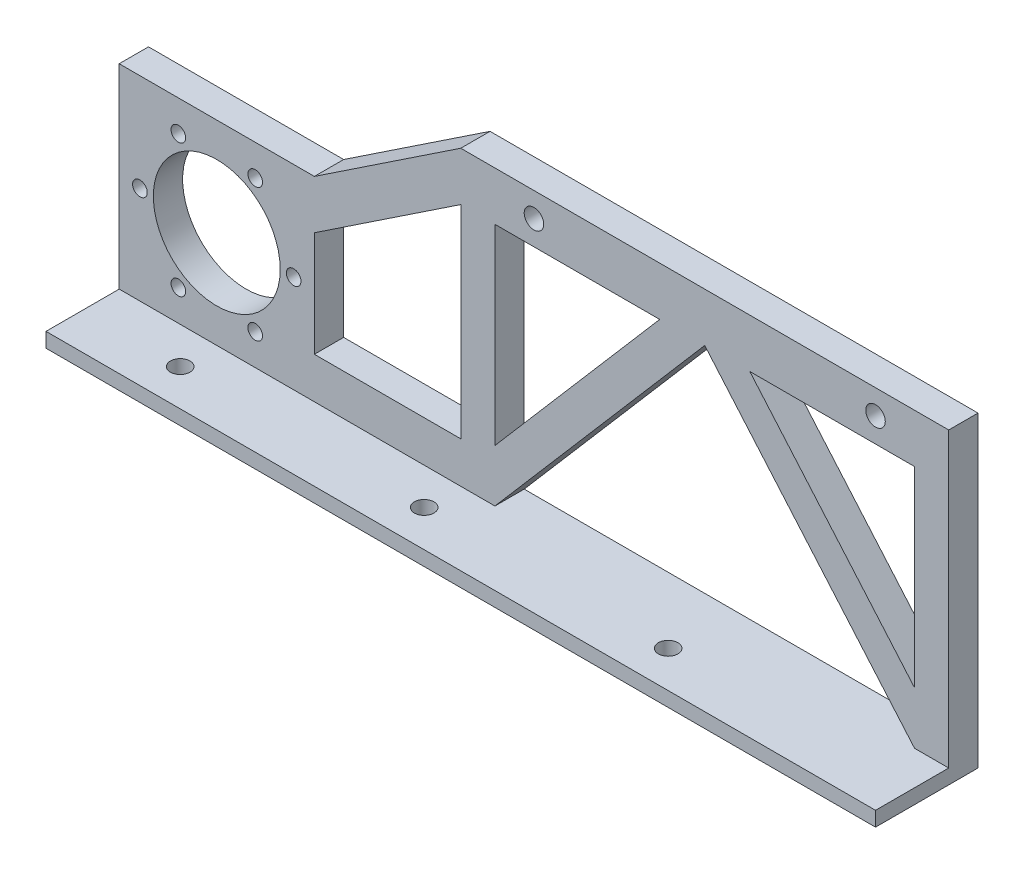
ISO-10303-21;
HEADER;
FILE_DESCRIPTION(('STEP AP214'),'2;1');
FILE_NAME('part.step','',(''),(''),'','','');
FILE_SCHEMA(('AUTOMOTIVE_DESIGN { 1 0 10303 214 1 1 1 1 }'));
ENDSEC;
DATA;
#1=APPLICATION_CONTEXT('core data for automotive mechanical design processes');
#2=APPLICATION_PROTOCOL_DEFINITION('international standard','automotive_design',2000,#1);
#3=PRODUCT_CONTEXT('',#1,'mechanical');
#4=PRODUCT('Part','Part','',(#3));
#5=PRODUCT_RELATED_PRODUCT_CATEGORY('part','',(#4));
#6=PRODUCT_DEFINITION_FORMATION('','',#4);
#7=PRODUCT_DEFINITION_CONTEXT('part definition',#1,'design');
#8=PRODUCT_DEFINITION('design','',#6,#7);
#9=PRODUCT_DEFINITION_SHAPE('','',#8);
#10=(LENGTH_UNIT() NAMED_UNIT(*) SI_UNIT(.MILLI.,.METRE.));
#11=(NAMED_UNIT(*) PLANE_ANGLE_UNIT() SI_UNIT($,.RADIAN.));
#12=(NAMED_UNIT(*) SI_UNIT($,.STERADIAN.) SOLID_ANGLE_UNIT());
#13=UNCERTAINTY_MEASURE_WITH_UNIT(LENGTH_MEASURE(1.E-05),#10,'distance_accuracy_value','');
#14=(GEOMETRIC_REPRESENTATION_CONTEXT(3) GLOBAL_UNCERTAINTY_ASSIGNED_CONTEXT((#13)) GLOBAL_UNIT_ASSIGNED_CONTEXT((#10,
#11,#12)) REPRESENTATION_CONTEXT('',''));
#15=CARTESIAN_POINT('',(0.,0.,0.));
#16=DIRECTION('',(0.,0.,1.));
#17=DIRECTION('',(1.,0.,0.));
#18=AXIS2_PLACEMENT_3D('',#15,#16,#17);
#19=CARTESIAN_POINT('',(0.,-5.,6.));
#20=DIRECTION('',(0.,1.,0.));
#21=DIRECTION('',(0.,0.,1.));
#22=AXIS2_PLACEMENT_3D('',#19,#20,#21);
#23=PLANE('',#22);
#24=DIRECTION('',(1.,0.,0.));
#25=VECTOR('',#24,1.);
#26=CARTESIAN_POINT('',(0.,-5.,0.));
#27=LINE('',#26,#25);
#28=CARTESIAN_POINT('',(-43.,-5.,0.));
#29=VERTEX_POINT('',#28);
#30=CARTESIAN_POINT('',(-9.23257277252664,-5.,0.));
#31=VERTEX_POINT('',#30);
#32=EDGE_CURVE('E164',#29,#31,#27,.T.);
#33=ORIENTED_EDGE('',*,*,#32,.T.);
#34=DIRECTION('',(0.,0.,-1.));
#35=VECTOR('',#34,1.);
#36=CARTESIAN_POINT('',(-9.23257277252664,-5.,6.));
#37=LINE('',#36,#35);
#38=CARTESIAN_POINT('',(-9.23257277252664,-5.,6.));
#39=VERTEX_POINT('',#38);
#40=EDGE_CURVE('E11',#39,#31,#37,.T.);
#41=ORIENTED_EDGE('',*,*,#40,.F.);
#42=DIRECTION('',(1.,0.,0.));
#43=VECTOR('',#42,1.);
#44=CARTESIAN_POINT('',(0.,-5.,6.));
#45=LINE('',#44,#43);
#46=CARTESIAN_POINT('',(-43.,-5.,6.));
#47=VERTEX_POINT('',#46);
#48=EDGE_CURVE('E155',#47,#39,#45,.T.);
#49=ORIENTED_EDGE('',*,*,#48,.F.);
#50=DIRECTION('',(0.,0.,-1.));
#51=VECTOR('',#50,1.);
#52=CARTESIAN_POINT('',(-43.,-5.,6.));
#53=LINE('',#52,#51);
#54=EDGE_CURVE('E54',#47,#29,#53,.T.);
#55=ORIENTED_EDGE('',*,*,#54,.T.);
#56=EDGE_LOOP('',(#33,#41,#49,#55));
#57=FACE_BOUND('',#56,.T.);
#58=ADVANCED_FACE('F35',(#57),#23,.F.);
#59=CARTESIAN_POINT('',(-2.83546376898519,2.43849884132727,6.));
#60=DIRECTION('',(-0.758185196311683,0.652039268828047,0.));
#61=DIRECTION('',(-0.652039268828047,-0.758185196311683,0.));
#62=AXIS2_PLACEMENT_3D('',#59,#60,#61);
#63=PLANE('',#62);
#64=DIRECTION('',(0.652039268828047,0.758185196311683,0.));
#65=VECTOR('',#64,1.);
#66=CARTESIAN_POINT('',(-2.83546376898519,2.43849884132727,0.));
#67=LINE('',#66,#65);
#68=CARTESIAN_POINT('',(-43.,-44.2644502645039,0.));
#69=VERTEX_POINT('',#68);
#70=EDGE_CURVE('E241',#69,#31,#67,.T.);
#71=ORIENTED_EDGE('',*,*,#70,.F.);
#72=DIRECTION('',(0.,0.,-1.));
#73=VECTOR('',#72,1.);
#74=CARTESIAN_POINT('',(-43.,-44.2644502645039,6.));
#75=LINE('',#74,#73);
#76=CARTESIAN_POINT('',(-43.,-44.2644502645039,6.));
#77=VERTEX_POINT('',#76);
#78=EDGE_CURVE('E45',#77,#69,#75,.T.);
#79=ORIENTED_EDGE('',*,*,#78,.F.);
#80=DIRECTION('',(0.652039268828047,0.758185196311683,0.));
#81=VECTOR('',#80,1.);
#82=CARTESIAN_POINT('',(-2.83546376898519,2.43849884132727,6.));
#83=LINE('',#82,#81);
#84=EDGE_CURVE('E160',#77,#39,#83,.T.);
#85=ORIENTED_EDGE('',*,*,#84,.T.);
#86=ORIENTED_EDGE('',*,*,#40,.T.);
#87=EDGE_LOOP('',(#71,#79,#85,#86));
#88=FACE_BOUND('',#87,.T.);
#89=ADVANCED_FACE('F167',(#88),#63,.T.);
#90=CARTESIAN_POINT('',(43.,0.,6.));
#91=DIRECTION('',(1.,0.,0.));
#92=DIRECTION('',(0.,1.,0.));
#93=AXIS2_PLACEMENT_3D('',#90,#91,#92);
#94=PLANE('',#93);
#95=DIRECTION('',(0.,-1.,0.));
#96=VECTOR('',#95,1.);
#97=CARTESIAN_POINT('',(43.,0.,0.));
#98=LINE('',#97,#96);
#99=CARTESIAN_POINT('',(43.,-5.,0.));
#100=VERTEX_POINT('',#99);
#101=CARTESIAN_POINT('',(43.,-44.2644502645039,0.));
#102=VERTEX_POINT('',#101);
#103=EDGE_CURVE('E233',#100,#102,#98,.T.);
#104=ORIENTED_EDGE('',*,*,#103,.T.);
#105=DIRECTION('',(0.,0.,-1.));
#106=VECTOR('',#105,1.);
#107=CARTESIAN_POINT('',(43.,-44.2644502645039,6.));
#108=LINE('',#107,#106);
#109=CARTESIAN_POINT('',(43.,-44.2644502645039,6.));
#110=VERTEX_POINT('',#109);
#111=EDGE_CURVE('E275',#110,#102,#108,.T.);
#112=ORIENTED_EDGE('',*,*,#111,.F.);
#113=DIRECTION('',(0.,-1.,0.));
#114=VECTOR('',#113,1.);
#115=CARTESIAN_POINT('',(43.,0.,6.));
#116=LINE('',#115,#114);
#117=CARTESIAN_POINT('',(43.,-5.,6.));
#118=VERTEX_POINT('',#117);
#119=EDGE_CURVE('E388',#118,#110,#116,.T.);
#120=ORIENTED_EDGE('',*,*,#119,.F.);
#121=DIRECTION('',(0.,0.,-1.));
#122=VECTOR('',#121,1.);
#123=CARTESIAN_POINT('',(43.,-5.,6.));
#124=LINE('',#123,#122);
#125=EDGE_CURVE('E277',#118,#100,#124,.T.);
#126=ORIENTED_EDGE('',*,*,#125,.T.);
#127=EDGE_LOOP('',(#104,#112,#120,#126));
#128=FACE_BOUND('',#127,.T.);
#129=ADVANCED_FACE('F403',(#128),#94,.F.);
#130=CARTESIAN_POINT('',(2.83546376898519,2.43849884132726,6.));
#131=DIRECTION('',(0.758185196311683,0.652039268828047,0.));
#132=DIRECTION('',(-0.652039268828048,0.758185196311683,0.));
#133=AXIS2_PLACEMENT_3D('',#130,#131,#132);
#134=PLANE('',#133);
#135=DIRECTION('',(0.652039268828048,-0.758185196311683,0.));
#136=VECTOR('',#135,1.);
#137=CARTESIAN_POINT('',(2.83546376898519,2.43849884132726,0.));
#138=LINE('',#137,#136);
#139=CARTESIAN_POINT('',(9.23257277252663,-5.,0.));
#140=VERTEX_POINT('',#139);
#141=EDGE_CURVE('E236',#140,#102,#138,.T.);
#142=ORIENTED_EDGE('',*,*,#141,.F.);
#143=DIRECTION('',(0.,0.,-1.));
#144=VECTOR('',#143,1.);
#145=CARTESIAN_POINT('',(9.23257277252663,-5.,6.));
#146=LINE('',#145,#144);
#147=CARTESIAN_POINT('',(9.23257277252663,-5.,6.));
#148=VERTEX_POINT('',#147);
#149=EDGE_CURVE('E280',#148,#140,#146,.T.);
#150=ORIENTED_EDGE('',*,*,#149,.F.);
#151=DIRECTION('',(0.652039268828048,-0.758185196311683,0.));
#152=VECTOR('',#151,1.);
#153=CARTESIAN_POINT('',(2.83546376898519,2.43849884132726,6.));
#154=LINE('',#153,#152);
#155=EDGE_CURVE('E389',#148,#110,#154,.T.);
#156=ORIENTED_EDGE('',*,*,#155,.T.);
#157=ORIENTED_EDGE('',*,*,#111,.T.);
#158=EDGE_LOOP('',(#142,#150,#156,#157));
#159=FACE_BOUND('',#158,.T.);
#160=ADVANCED_FACE('F405',(#159),#134,.T.);
#161=CARTESIAN_POINT('',(-13.0769230769231,19.6153846153846,6.));
#162=DIRECTION('',(0.554700196225229,-0.832050294337844,0.));
#163=DIRECTION('',(0.832050294337844,0.554700196225229,0.));
#164=AXIS2_PLACEMENT_3D('',#161,#162,#163);
#165=PLANE('',#164);
#166=DIRECTION('',(-0.832050294337844,-0.554700196225229,0.));
#167=VECTOR('',#166,1.);
#168=CARTESIAN_POINT('',(-13.0769230769231,19.6153846153846,0.));
#169=LINE('',#168,#167);
#170=CARTESIAN_POINT('',(-50.,-5.,0.));
#171=VERTEX_POINT('',#170);
#172=CARTESIAN_POINT('',(-80.,-25.,0.));
#173=VERTEX_POINT('',#172);
#174=EDGE_CURVE('E221',#171,#173,#169,.T.);
#175=ORIENTED_EDGE('',*,*,#174,.F.);
#176=DIRECTION('',(0.,0.,-1.));
#177=VECTOR('',#176,1.);
#178=CARTESIAN_POINT('',(-50.,-5.,6.));
#179=LINE('',#178,#177);
#180=CARTESIAN_POINT('',(-50.,-5.,6.));
#181=VERTEX_POINT('',#180);
#182=EDGE_CURVE('E281',#181,#171,#179,.T.);
#183=ORIENTED_EDGE('',*,*,#182,.F.);
#184=DIRECTION('',(-0.832050294337844,-0.554700196225229,0.));
#185=VECTOR('',#184,1.);
#186=CARTESIAN_POINT('',(-13.0769230769231,19.6153846153846,6.));
#187=LINE('',#186,#185);
#188=CARTESIAN_POINT('',(-80.,-25.,6.));
#189=VERTEX_POINT('',#188);
#190=EDGE_CURVE('E377',#181,#189,#187,.T.);
#191=ORIENTED_EDGE('',*,*,#190,.T.);
#192=DIRECTION('',(0.,0.,-1.));
#193=VECTOR('',#192,1.);
#194=CARTESIAN_POINT('',(-80.,-25.,6.));
#195=LINE('',#194,#193);
#196=EDGE_CURVE('E284',#189,#173,#195,.T.);
#197=ORIENTED_EDGE('',*,*,#196,.T.);
#198=EDGE_LOOP('',(#175,#183,#191,#197));
#199=FACE_BOUND('',#198,.T.);
#200=ADVANCED_FACE('F779',(#199),#165,.T.);
#201=CARTESIAN_POINT('',(-50.,0.,6.));
#202=DIRECTION('',(1.,0.,0.));
#203=DIRECTION('',(0.,1.,0.));
#204=AXIS2_PLACEMENT_3D('',#201,#202,#203);
#205=PLANE('',#204);
#206=DIRECTION('',(0.,-1.,0.));
#207=VECTOR('',#206,1.);
#208=CARTESIAN_POINT('',(-50.,0.,0.));
#209=LINE('',#208,#207);
#210=CARTESIAN_POINT('',(-50.,-46.5715813831336,0.));
#211=VERTEX_POINT('',#210);
#212=EDGE_CURVE('E224',#171,#211,#209,.T.);
#213=ORIENTED_EDGE('',*,*,#212,.T.);
#214=DIRECTION('',(0.,0.,-1.));
#215=VECTOR('',#214,1.);
#216=CARTESIAN_POINT('',(-50.,-46.5715813831336,6.));
#217=LINE('',#216,#215);
#218=CARTESIAN_POINT('',(-50.,-46.5715813831336,6.));
#219=VERTEX_POINT('',#218);
#220=EDGE_CURVE('E290',#219,#211,#217,.T.);
#221=ORIENTED_EDGE('',*,*,#220,.F.);
#222=DIRECTION('',(0.,-1.,0.));
#223=VECTOR('',#222,1.);
#224=CARTESIAN_POINT('',(-50.,0.,6.));
#225=LINE('',#224,#223);
#226=EDGE_CURVE('E380',#181,#219,#225,.T.);
#227=ORIENTED_EDGE('',*,*,#226,.F.);
#228=ORIENTED_EDGE('',*,*,#182,.T.);
#229=EDGE_LOOP('',(#213,#221,#227,#228));
#230=FACE_BOUND('',#229,.T.);
#231=ADVANCED_FACE('F769',(#230),#205,.F.);
#232=CARTESIAN_POINT('',(0.,-46.5715813831336,6.));
#233=DIRECTION('',(0.,-1.,0.));
#234=DIRECTION('',(1.,0.,0.));
#235=AXIS2_PLACEMENT_3D('',#232,#233,#234);
#236=PLANE('',#235);
#237=DIRECTION('',(-1.,0.,0.));
#238=VECTOR('',#237,1.);
#239=CARTESIAN_POINT('',(0.,-46.5715813831336,0.));
#240=LINE('',#239,#238);
#241=CARTESIAN_POINT('',(-80.,-46.5715813831336,0.));
#242=VERTEX_POINT('',#241);
#243=EDGE_CURVE('E227',#211,#242,#240,.T.);
#244=ORIENTED_EDGE('',*,*,#243,.T.);
#245=DIRECTION('',(0.,0.,-1.));
#246=VECTOR('',#245,1.);
#247=CARTESIAN_POINT('',(-80.,-46.5715813831336,6.));
#248=LINE('',#247,#246);
#249=CARTESIAN_POINT('',(-80.,-46.5715813831336,6.));
#250=VERTEX_POINT('',#249);
#251=EDGE_CURVE('E286',#250,#242,#248,.T.);
#252=ORIENTED_EDGE('',*,*,#251,.F.);
#253=DIRECTION('',(-1.,0.,0.));
#254=VECTOR('',#253,1.);
#255=CARTESIAN_POINT('',(0.,-46.5715813831336,6.));
#256=LINE('',#255,#254);
#257=EDGE_CURVE('E383',#219,#250,#256,.T.);
#258=ORIENTED_EDGE('',*,*,#257,.F.);
#259=ORIENTED_EDGE('',*,*,#220,.T.);
#260=EDGE_LOOP('',(#244,#252,#258,#259));
#261=FACE_BOUND('',#260,.T.);
#262=ADVANCED_FACE('F528',(#261),#236,.F.);
#263=CARTESIAN_POINT('',(-2.4718326051966,-2.12577604046907,6.));
#264=DIRECTION('',(0.758185196311683,0.652039268828047,0.));
#265=DIRECTION('',(-0.652039268828048,0.758185196311683,0.));
#266=AXIS2_PLACEMENT_3D('',#263,#264,#265);
#267=PLANE('',#266);
#268=DIRECTION('',(0.652039268828048,-0.758185196311683,0.));
#269=VECTOR('',#268,1.);
#270=CARTESIAN_POINT('',(-2.4718326051966,-2.12577604046907,0.));
#271=LINE('',#270,#269);
#272=CARTESIAN_POINT('',(0.,-5.,0.));
#273=VERTEX_POINT('',#272);
#274=CARTESIAN_POINT('',(43.,-55.,0.));
#275=VERTEX_POINT('',#274);
#276=EDGE_CURVE('E200',#273,#275,#271,.T.);
#277=ORIENTED_EDGE('',*,*,#276,.T.);
#278=DIRECTION('',(0.,0.,-1.));
#279=VECTOR('',#278,1.);
#280=CARTESIAN_POINT('',(43.,-55.,6.));
#281=LINE('',#280,#279);
#282=CARTESIAN_POINT('',(43.,-55.,6.));
#283=VERTEX_POINT('',#282);
#284=EDGE_CURVE('E287',#283,#275,#281,.T.);
#285=ORIENTED_EDGE('',*,*,#284,.F.);
#286=DIRECTION('',(0.652039268828048,-0.758185196311683,0.));
#287=VECTOR('',#286,1.);
#288=CARTESIAN_POINT('',(-2.4718326051966,-2.12577604046907,6.));
#289=LINE('',#288,#287);
#290=CARTESIAN_POINT('',(0.,-5.,6.));
#291=VERTEX_POINT('',#290);
#292=EDGE_CURVE('E273',#291,#283,#289,.T.);
#293=ORIENTED_EDGE('',*,*,#292,.F.);
#294=DIRECTION('',(0.,0.,-1.));
#295=VECTOR('',#294,1.);
#296=CARTESIAN_POINT('',(0.,-5.,6.));
#297=LINE('',#296,#295);
#298=EDGE_CURVE('E199',#291,#273,#297,.T.);
#299=ORIENTED_EDGE('',*,*,#298,.T.);
#300=EDGE_LOOP('',(#277,#285,#293,#299));
#301=FACE_BOUND('',#300,.T.);
#302=ADVANCED_FACE('F37',(#301),#267,.F.);
#303=CARTESIAN_POINT('',(50.,0.,6.));
#304=DIRECTION('',(1.,0.,0.));
#305=DIRECTION('',(0.,0.,-1.));
#306=AXIS2_PLACEMENT_3D('',#303,#304,#305);
#307=PLANE('',#306);
#308=DIRECTION('',(0.,-1.,0.));
#309=VECTOR('',#308,1.);
#310=CARTESIAN_POINT('',(50.,0.,0.));
#311=LINE('',#310,#309);
#312=CARTESIAN_POINT('',(50.,5.,0.));
#313=VERTEX_POINT('',#312);
#314=CARTESIAN_POINT('',(50.,-58.,0.));
#315=VERTEX_POINT('',#314);
#316=EDGE_CURVE('E203',#313,#315,#311,.T.);
#317=ORIENTED_EDGE('',*,*,#316,.F.);
#318=DIRECTION('',(0.,0.,-1.));
#319=VECTOR('',#318,1.);
#320=CARTESIAN_POINT('',(50.,5.,6.));
#321=LINE('',#320,#319);
#322=CARTESIAN_POINT('',(50.,5.,6.));
#323=VERTEX_POINT('',#322);
#324=EDGE_CURVE('E115',#323,#313,#321,.T.);
#325=ORIENTED_EDGE('',*,*,#324,.F.);
#326=DIRECTION('',(0.,-1.,0.));
#327=VECTOR('',#326,1.);
#328=CARTESIAN_POINT('',(50.,0.,6.));
#329=LINE('',#328,#327);
#330=CARTESIAN_POINT('',(50.,-55.,6.));
#331=VERTEX_POINT('',#330);
#332=EDGE_CURVE('E359',#323,#331,#329,.T.);
#333=ORIENTED_EDGE('',*,*,#332,.T.);
#334=DIRECTION('',(0.,0.,1.));
#335=VECTOR('',#334,1.);
#336=CARTESIAN_POINT('',(50.,-55.,0.));
#337=LINE('',#336,#335);
#338=CARTESIAN_POINT('',(50.,-55.,21.));
#339=VERTEX_POINT('',#338);
#340=EDGE_CURVE('E346',#331,#339,#337,.T.);
#341=ORIENTED_EDGE('',*,*,#340,.T.);
#342=DIRECTION('',(0.,1.,0.));
#343=VECTOR('',#342,1.);
#344=CARTESIAN_POINT('',(50.,-55.,21.));
#345=LINE('',#344,#343);
#346=CARTESIAN_POINT('',(50.,-58.,21.));
#347=VERTEX_POINT('',#346);
#348=EDGE_CURVE('E327',#347,#339,#345,.T.);
#349=ORIENTED_EDGE('',*,*,#348,.F.);
#350=DIRECTION('',(0.,0.,1.));
#351=VECTOR('',#350,1.);
#352=CARTESIAN_POINT('',(50.,-58.,0.));
#353=LINE('',#352,#351);
#354=EDGE_CURVE('E349',#315,#347,#353,.T.);
#355=ORIENTED_EDGE('',*,*,#354,.F.);
#356=EDGE_LOOP('',(#317,#325,#333,#341,#349,#355));
#357=FACE_BOUND('',#356,.T.);
#358=ADVANCED_FACE('F522',(#357),#307,.T.);
#359=CARTESIAN_POINT('',(0.,5.,6.));
#360=DIRECTION('',(0.,1.,0.));
#361=DIRECTION('',(0.,0.,1.));
#362=AXIS2_PLACEMENT_3D('',#359,#360,#361);
#363=PLANE('',#362);
#364=DIRECTION('',(1.,0.,0.));
#365=VECTOR('',#364,1.);
#366=CARTESIAN_POINT('',(0.,5.,0.));
#367=LINE('',#366,#365);
#368=CARTESIAN_POINT('',(-50.,5.,0.));
#369=VERTEX_POINT('',#368);
#370=EDGE_CURVE('E207',#369,#313,#367,.T.);
#371=ORIENTED_EDGE('',*,*,#370,.F.);
#372=DIRECTION('',(0.,0.,-1.));
#373=VECTOR('',#372,1.);
#374=CARTESIAN_POINT('',(-50.,5.,6.));
#375=LINE('',#374,#373);
#376=CARTESIAN_POINT('',(-50.,5.,6.));
#377=VERTEX_POINT('',#376);
#378=EDGE_CURVE('E303',#377,#369,#375,.T.);
#379=ORIENTED_EDGE('',*,*,#378,.F.);
#380=DIRECTION('',(1.,0.,0.));
#381=VECTOR('',#380,1.);
#382=CARTESIAN_POINT('',(0.,5.,6.));
#383=LINE('',#382,#381);
#384=EDGE_CURVE('E361',#377,#323,#383,.T.);
#385=ORIENTED_EDGE('',*,*,#384,.T.);
#386=ORIENTED_EDGE('',*,*,#324,.T.);
#387=EDGE_LOOP('',(#371,#379,#385,#386));
#388=FACE_BOUND('',#387,.T.);
#389=ADVANCED_FACE('F519',(#388),#363,.T.);
#390=CARTESIAN_POINT('',(-17.6923076923077,26.5384615384615,6.));
#391=DIRECTION('',(-0.554700196225229,0.832050294337844,0.));
#392=DIRECTION('',(-0.832050294337844,-0.554700196225229,0.));
#393=AXIS2_PLACEMENT_3D('',#390,#391,#392);
#394=PLANE('',#393);
#395=DIRECTION('',(0.832050294337844,0.554700196225229,0.));
#396=VECTOR('',#395,1.);
#397=CARTESIAN_POINT('',(-17.6923076923077,26.5384615384615,0.));
#398=LINE('',#397,#396);
#399=CARTESIAN_POINT('',(-80.,-15.,0.));
#400=VERTEX_POINT('',#399);
#401=EDGE_CURVE('E210',#400,#369,#398,.T.);
#402=ORIENTED_EDGE('',*,*,#401,.F.);
#403=DIRECTION('',(0.,0.,-1.));
#404=VECTOR('',#403,1.);
#405=CARTESIAN_POINT('',(-80.,-15.,6.));
#406=LINE('',#405,#404);
#407=CARTESIAN_POINT('',(-80.,-15.,6.));
#408=VERTEX_POINT('',#407);
#409=EDGE_CURVE('E301',#408,#400,#406,.T.);
#410=ORIENTED_EDGE('',*,*,#409,.F.);
#411=DIRECTION('',(0.832050294337844,0.554700196225229,0.));
#412=VECTOR('',#411,1.);
#413=CARTESIAN_POINT('',(-17.6923076923077,26.5384615384615,6.));
#414=LINE('',#413,#412);
#415=EDGE_CURVE('E364',#408,#377,#414,.T.);
#416=ORIENTED_EDGE('',*,*,#415,.T.);
#417=ORIENTED_EDGE('',*,*,#378,.T.);
#418=EDGE_LOOP('',(#402,#410,#416,#417));
#419=FACE_BOUND('',#418,.T.);
#420=ADVANCED_FACE('F511',(#419),#394,.T.);
#421=CARTESIAN_POINT('',(0.,-15.,6.));
#422=DIRECTION('',(0.,-1.,0.));
#423=DIRECTION('',(1.,0.,0.));
#424=AXIS2_PLACEMENT_3D('',#421,#422,#423);
#425=PLANE('',#424);
#426=DIRECTION('',(-1.,0.,0.));
#427=VECTOR('',#426,1.);
#428=CARTESIAN_POINT('',(0.,-15.,0.));
#429=LINE('',#428,#427);
#430=CARTESIAN_POINT('',(-120.,-15.,0.));
#431=VERTEX_POINT('',#430);
#432=EDGE_CURVE('E213',#400,#431,#429,.T.);
#433=ORIENTED_EDGE('',*,*,#432,.T.);
#434=DIRECTION('',(0.,0.,-1.));
#435=VECTOR('',#434,1.);
#436=CARTESIAN_POINT('',(-120.,-15.,6.));
#437=LINE('',#436,#435);
#438=CARTESIAN_POINT('',(-120.,-15.,6.));
#439=VERTEX_POINT('',#438);
#440=EDGE_CURVE('E299',#439,#431,#437,.T.);
#441=ORIENTED_EDGE('',*,*,#440,.F.);
#442=DIRECTION('',(-1.,0.,0.));
#443=VECTOR('',#442,1.);
#444=CARTESIAN_POINT('',(0.,-15.,6.));
#445=LINE('',#444,#443);
#446=EDGE_CURVE('E367',#408,#439,#445,.T.);
#447=ORIENTED_EDGE('',*,*,#446,.F.);
#448=ORIENTED_EDGE('',*,*,#409,.T.);
#449=EDGE_LOOP('',(#433,#441,#447,#448));
#450=FACE_BOUND('',#449,.T.);
#451=ADVANCED_FACE('F500',(#450),#425,.F.);
#452=CARTESIAN_POINT('',(-120.,0.,6.));
#453=DIRECTION('',(-1.,0.,0.));
#454=DIRECTION('',(0.,0.,1.));
#455=AXIS2_PLACEMENT_3D('',#452,#453,#454);
#456=PLANE('',#455);
#457=DIRECTION('',(0.,1.,0.));
#458=VECTOR('',#457,1.);
#459=CARTESIAN_POINT('',(-120.,0.,0.));
#460=LINE('',#459,#458);
#461=CARTESIAN_POINT('',(-120.,-58.,0.));
#462=VERTEX_POINT('',#461);
#463=EDGE_CURVE('E216',#462,#431,#460,.T.);
#464=ORIENTED_EDGE('',*,*,#463,.F.);
#465=DIRECTION('',(0.,0.,1.));
#466=VECTOR('',#465,1.);
#467=CARTESIAN_POINT('',(-120.,-58.,0.));
#468=LINE('',#467,#466);
#469=CARTESIAN_POINT('',(-120.,-58.,21.));
#470=VERTEX_POINT('',#469);
#471=EDGE_CURVE('E343',#462,#470,#468,.T.);
#472=ORIENTED_EDGE('',*,*,#471,.T.);
#473=DIRECTION('',(0.,-1.,0.));
#474=VECTOR('',#473,1.);
#475=CARTESIAN_POINT('',(-120.,-55.,21.));
#476=LINE('',#475,#474);
#477=CARTESIAN_POINT('',(-120.,-55.,21.));
#478=VERTEX_POINT('',#477);
#479=EDGE_CURVE('E316',#478,#470,#476,.T.);
#480=ORIENTED_EDGE('',*,*,#479,.F.);
#481=DIRECTION('',(0.,0.,1.));
#482=VECTOR('',#481,1.);
#483=CARTESIAN_POINT('',(-120.,-55.,0.));
#484=LINE('',#483,#482);
#485=CARTESIAN_POINT('',(-120.,-55.,6.));
#486=VERTEX_POINT('',#485);
#487=EDGE_CURVE('E204',#486,#478,#484,.T.);
#488=ORIENTED_EDGE('',*,*,#487,.F.);
#489=DIRECTION('',(0.,1.,0.));
#490=VECTOR('',#489,1.);
#491=CARTESIAN_POINT('',(-120.,0.,6.));
#492=LINE('',#491,#490);
#493=EDGE_CURVE('E369',#486,#439,#492,.T.);
#494=ORIENTED_EDGE('',*,*,#493,.T.);
#495=ORIENTED_EDGE('',*,*,#440,.T.);
#496=EDGE_LOOP('',(#464,#472,#480,#488,#494,#495));
#497=FACE_BOUND('',#496,.T.);
#498=ADVANCED_FACE('F495',(#497),#456,.T.);
#499=CARTESIAN_POINT('',(35.,0.,6.));
#500=DIRECTION('',(0.,0.,-1.));
#501=DIRECTION('',(-1.,0.,0.));
#502=AXIS2_PLACEMENT_3D('',#499,#500,#501);
#503=CYLINDRICAL_SURFACE('',#502,2.);
#504=CARTESIAN_POINT('',(35.,0.,6.));
#505=DIRECTION('',(0.,0.,1.));
#506=DIRECTION('',(1.,0.,0.));
#507=AXIS2_PLACEMENT_3D('',#504,#505,#506);
#508=CIRCLE('',#507,2.);
#509=CARTESIAN_POINT('',(37.,0.,6.));
#510=VERTEX_POINT('',#509);
#511=EDGE_CURVE('E193',#510,#510,#508,.T.);
#512=ORIENTED_EDGE('',*,*,#511,.T.);
#513=EDGE_LOOP('',(#512));
#514=FACE_BOUND('',#513,.T.);
#515=CARTESIAN_POINT('',(35.,0.,0.));
#516=DIRECTION('',(0.,0.,1.));
#517=DIRECTION('',(1.,0.,0.));
#518=AXIS2_PLACEMENT_3D('',#515,#516,#517);
#519=CIRCLE('',#518,2.);
#520=CARTESIAN_POINT('',(37.,0.,0.));
#521=VERTEX_POINT('',#520);
#522=EDGE_CURVE('E267',#521,#521,#519,.T.);
#523=ORIENTED_EDGE('',*,*,#522,.F.);
#524=EDGE_LOOP('',(#523));
#525=FACE_BOUND('',#524,.T.);
#526=ADVANCED_FACE('F492',(#514,#525),#503,.F.);
#527=CARTESIAN_POINT('',(-100.,-35.,6.));
#528=DIRECTION('',(0.,0.,-1.));
#529=DIRECTION('',(-1.,0.,0.));
#530=AXIS2_PLACEMENT_3D('',#527,#528,#529);
#531=CYLINDRICAL_SURFACE('',#530,13.);
#532=CARTESIAN_POINT('',(-100.,-35.,6.));
#533=DIRECTION('',(0.,0.,1.));
#534=DIRECTION('',(1.,0.,0.));
#535=AXIS2_PLACEMENT_3D('',#532,#533,#534);
#536=CIRCLE('',#535,13.);
#537=CARTESIAN_POINT('',(-87.,-35.,6.));
#538=VERTEX_POINT('',#537);
#539=EDGE_CURVE('E190',#538,#538,#536,.T.);
#540=ORIENTED_EDGE('',*,*,#539,.T.);
#541=EDGE_LOOP('',(#540));
#542=FACE_BOUND('',#541,.T.);
#543=CARTESIAN_POINT('',(-100.,-35.,0.));
#544=DIRECTION('',(0.,0.,1.));
#545=DIRECTION('',(1.,0.,0.));
#546=AXIS2_PLACEMENT_3D('',#543,#544,#545);
#547=CIRCLE('',#546,13.);
#548=CARTESIAN_POINT('',(-87.,-35.,0.));
#549=VERTEX_POINT('',#548);
#550=EDGE_CURVE('E264',#549,#549,#547,.T.);
#551=ORIENTED_EDGE('',*,*,#550,.F.);
#552=EDGE_LOOP('',(#551));
#553=FACE_BOUND('',#552,.T.);
#554=ADVANCED_FACE('F489',(#542,#553),#531,.F.);
#555=CARTESIAN_POINT('',(-84.25,-35.,6.));
#556=DIRECTION('',(0.,0.,-1.));
#557=DIRECTION('',(-1.,0.,0.));
#558=AXIS2_PLACEMENT_3D('',#555,#556,#557);
#559=CYLINDRICAL_SURFACE('',#558,1.5);
#560=CARTESIAN_POINT('',(-84.25,-35.,6.));
#561=DIRECTION('',(0.,0.,1.));
#562=DIRECTION('',(1.,0.,0.));
#563=AXIS2_PLACEMENT_3D('',#560,#561,#562);
#564=CIRCLE('',#563,1.5);
#565=CARTESIAN_POINT('',(-82.75,-35.,6.));
#566=VERTEX_POINT('',#565);
#567=EDGE_CURVE('E187',#566,#566,#564,.T.);
#568=ORIENTED_EDGE('',*,*,#567,.T.);
#569=EDGE_LOOP('',(#568));
#570=FACE_BOUND('',#569,.T.);
#571=CARTESIAN_POINT('',(-84.25,-35.,0.));
#572=DIRECTION('',(0.,0.,1.));
#573=DIRECTION('',(1.,0.,0.));
#574=AXIS2_PLACEMENT_3D('',#571,#572,#573);
#575=CIRCLE('',#574,1.5);
#576=CARTESIAN_POINT('',(-82.75,-35.,0.));
#577=VERTEX_POINT('',#576);
#578=EDGE_CURVE('E261',#577,#577,#575,.T.);
#579=ORIENTED_EDGE('',*,*,#578,.F.);
#580=EDGE_LOOP('',(#579));
#581=FACE_BOUND('',#580,.T.);
#582=ADVANCED_FACE('F485',(#570,#581),#559,.F.);
#583=CARTESIAN_POINT('',(-92.125,-48.6399001096049,6.));
#584=DIRECTION('',(0.,0.,-1.));
#585=DIRECTION('',(-1.,0.,0.));
#586=AXIS2_PLACEMENT_3D('',#583,#584,#585);
#587=CYLINDRICAL_SURFACE('',#586,1.49999999999998);
#588=CARTESIAN_POINT('',(-92.125,-48.6399001096049,6.));
#589=DIRECTION('',(0.,0.,1.));
#590=DIRECTION('',(1.,0.,0.));
#591=AXIS2_PLACEMENT_3D('',#588,#589,#590);
#592=CIRCLE('',#591,1.49999999999998);
#593=CARTESIAN_POINT('',(-90.625,-48.6399001096049,6.));
#594=VERTEX_POINT('',#593);
#595=EDGE_CURVE('E184',#594,#594,#592,.T.);
#596=ORIENTED_EDGE('',*,*,#595,.T.);
#597=EDGE_LOOP('',(#596));
#598=FACE_BOUND('',#597,.T.);
#599=CARTESIAN_POINT('',(-92.125,-48.6399001096049,0.));
#600=DIRECTION('',(0.,0.,1.));
#601=DIRECTION('',(1.,0.,0.));
#602=AXIS2_PLACEMENT_3D('',#599,#600,#601);
#603=CIRCLE('',#602,1.49999999999998);
#604=CARTESIAN_POINT('',(-90.625,-48.6399001096049,0.));
#605=VERTEX_POINT('',#604);
#606=EDGE_CURVE('E258',#605,#605,#603,.T.);
#607=ORIENTED_EDGE('',*,*,#606,.F.);
#608=EDGE_LOOP('',(#607));
#609=FACE_BOUND('',#608,.T.);
#610=ADVANCED_FACE('F481',(#598,#609),#587,.F.);
#611=CARTESIAN_POINT('',(-107.875,-48.639900109605,6.));
#612=DIRECTION('',(0.,0.,-1.));
#613=DIRECTION('',(-1.,0.,0.));
#614=AXIS2_PLACEMENT_3D('',#611,#612,#613);
#615=CYLINDRICAL_SURFACE('',#614,1.5);
#616=CARTESIAN_POINT('',(-107.875,-48.639900109605,6.));
#617=DIRECTION('',(0.,0.,1.));
#618=DIRECTION('',(1.,0.,0.));
#619=AXIS2_PLACEMENT_3D('',#616,#617,#618);
#620=CIRCLE('',#619,1.5);
#621=CARTESIAN_POINT('',(-106.375,-48.639900109605,6.));
#622=VERTEX_POINT('',#621);
#623=EDGE_CURVE('E181',#622,#622,#620,.T.);
#624=ORIENTED_EDGE('',*,*,#623,.T.);
#625=EDGE_LOOP('',(#624));
#626=FACE_BOUND('',#625,.T.);
#627=CARTESIAN_POINT('',(-107.875,-48.639900109605,0.));
#628=DIRECTION('',(0.,0.,1.));
#629=DIRECTION('',(1.,0.,0.));
#630=AXIS2_PLACEMENT_3D('',#627,#628,#629);
#631=CIRCLE('',#630,1.5);
#632=CARTESIAN_POINT('',(-106.375,-48.639900109605,0.));
#633=VERTEX_POINT('',#632);
#634=EDGE_CURVE('E255',#633,#633,#631,.T.);
#635=ORIENTED_EDGE('',*,*,#634,.F.);
#636=EDGE_LOOP('',(#635));
#637=FACE_BOUND('',#636,.T.);
#638=ADVANCED_FACE('F477',(#626,#637),#615,.F.);
#639=CARTESIAN_POINT('',(-115.75,-35.,6.));
#640=DIRECTION('',(0.,0.,-1.));
#641=DIRECTION('',(-1.,0.,0.));
#642=AXIS2_PLACEMENT_3D('',#639,#640,#641);
#643=CYLINDRICAL_SURFACE('',#642,1.5);
#644=CARTESIAN_POINT('',(-115.75,-35.,6.));
#645=DIRECTION('',(0.,0.,1.));
#646=DIRECTION('',(1.,0.,0.));
#647=AXIS2_PLACEMENT_3D('',#644,#645,#646);
#648=CIRCLE('',#647,1.5);
#649=CARTESIAN_POINT('',(-114.25,-35.,6.));
#650=VERTEX_POINT('',#649);
#651=EDGE_CURVE('E178',#650,#650,#648,.T.);
#652=ORIENTED_EDGE('',*,*,#651,.T.);
#653=EDGE_LOOP('',(#652));
#654=FACE_BOUND('',#653,.T.);
#655=CARTESIAN_POINT('',(-115.75,-35.,0.));
#656=DIRECTION('',(0.,0.,1.));
#657=DIRECTION('',(1.,0.,0.));
#658=AXIS2_PLACEMENT_3D('',#655,#656,#657);
#659=CIRCLE('',#658,1.5);
#660=CARTESIAN_POINT('',(-114.25,-35.,0.));
#661=VERTEX_POINT('',#660);
#662=EDGE_CURVE('E252',#661,#661,#659,.T.);
#663=ORIENTED_EDGE('',*,*,#662,.F.);
#664=EDGE_LOOP('',(#663));
#665=FACE_BOUND('',#664,.T.);
#666=ADVANCED_FACE('F473',(#654,#665),#643,.F.);
#667=CARTESIAN_POINT('',(-107.875,-21.3600998903951,6.));
#668=DIRECTION('',(0.,0.,-1.));
#669=DIRECTION('',(-1.,0.,0.));
#670=AXIS2_PLACEMENT_3D('',#667,#668,#669);
#671=CYLINDRICAL_SURFACE('',#670,1.5);
#672=CARTESIAN_POINT('',(-107.875,-21.3600998903951,6.));
#673=DIRECTION('',(0.,0.,1.));
#674=DIRECTION('',(1.,0.,0.));
#675=AXIS2_PLACEMENT_3D('',#672,#673,#674);
#676=CIRCLE('',#675,1.5);
#677=CARTESIAN_POINT('',(-106.375,-21.3600998903951,6.));
#678=VERTEX_POINT('',#677);
#679=EDGE_CURVE('E175',#678,#678,#676,.T.);
#680=ORIENTED_EDGE('',*,*,#679,.T.);
#681=EDGE_LOOP('',(#680));
#682=FACE_BOUND('',#681,.T.);
#683=CARTESIAN_POINT('',(-107.875,-21.3600998903951,0.));
#684=DIRECTION('',(0.,0.,1.));
#685=DIRECTION('',(1.,0.,0.));
#686=AXIS2_PLACEMENT_3D('',#683,#684,#685);
#687=CIRCLE('',#686,1.5);
#688=CARTESIAN_POINT('',(-106.375,-21.3600998903951,0.));
#689=VERTEX_POINT('',#688);
#690=EDGE_CURVE('E249',#689,#689,#687,.T.);
#691=ORIENTED_EDGE('',*,*,#690,.F.);
#692=EDGE_LOOP('',(#691));
#693=FACE_BOUND('',#692,.T.);
#694=ADVANCED_FACE('F467',(#682,#693),#671,.F.);
#695=CARTESIAN_POINT('',(-92.125,-21.3600998903951,6.));
#696=DIRECTION('',(0.,0.,-1.));
#697=DIRECTION('',(-1.,0.,0.));
#698=AXIS2_PLACEMENT_3D('',#695,#696,#697);
#699=CYLINDRICAL_SURFACE('',#698,1.5);
#700=CARTESIAN_POINT('',(-92.125,-21.3600998903951,6.));
#701=DIRECTION('',(0.,0.,1.));
#702=DIRECTION('',(1.,0.,0.));
#703=AXIS2_PLACEMENT_3D('',#700,#701,#702);
#704=CIRCLE('',#703,1.5);
#705=CARTESIAN_POINT('',(-90.625,-21.3600998903951,6.));
#706=VERTEX_POINT('',#705);
#707=EDGE_CURVE('E169',#706,#706,#704,.T.);
#708=ORIENTED_EDGE('',*,*,#707,.T.);
#709=EDGE_LOOP('',(#708));
#710=FACE_BOUND('',#709,.T.);
#711=CARTESIAN_POINT('',(-92.125,-21.3600998903951,0.));
#712=DIRECTION('',(0.,0.,1.));
#713=DIRECTION('',(1.,0.,0.));
#714=AXIS2_PLACEMENT_3D('',#711,#712,#713);
#715=CIRCLE('',#714,1.5);
#716=CARTESIAN_POINT('',(-90.625,-21.3600998903951,0.));
#717=VERTEX_POINT('',#716);
#718=EDGE_CURVE('E246',#717,#717,#715,.T.);
#719=ORIENTED_EDGE('',*,*,#718,.F.);
#720=EDGE_LOOP('',(#719));
#721=FACE_BOUND('',#720,.T.);
#722=ADVANCED_FACE('F462',(#710,#721),#699,.F.);
#723=CARTESIAN_POINT('',(-43.,0.,6.));
#724=DIRECTION('',(1.,0.,0.));
#725=DIRECTION('',(0.,1.,0.));
#726=AXIS2_PLACEMENT_3D('',#723,#724,#725);
#727=PLANE('',#726);
#728=DIRECTION('',(0.,-1.,0.));
#729=VECTOR('',#728,1.);
#730=CARTESIAN_POINT('',(-43.,0.,0.));
#731=LINE('',#730,#729);
#732=EDGE_CURVE('E243',#29,#69,#731,.T.);
#733=ORIENTED_EDGE('',*,*,#732,.F.);
#734=ORIENTED_EDGE('',*,*,#54,.F.);
#735=DIRECTION('',(0.,-1.,0.));
#736=VECTOR('',#735,1.);
#737=CARTESIAN_POINT('',(-43.,0.,6.));
#738=LINE('',#737,#736);
#739=EDGE_CURVE('E161',#47,#77,#738,.T.);
#740=ORIENTED_EDGE('',*,*,#739,.T.);
#741=ORIENTED_EDGE('',*,*,#78,.T.);
#742=EDGE_LOOP('',(#733,#734,#740,#741));
#743=FACE_BOUND('',#742,.T.);
#744=ADVANCED_FACE('F455',(#743),#727,.T.);
#745=EDGE_CURVE('E239',#140,#100,#27,.T.);
#746=ORIENTED_EDGE('',*,*,#745,.T.);
#747=ORIENTED_EDGE('',*,*,#125,.F.);
#748=EDGE_CURVE('E162',#148,#118,#45,.T.);
#749=ORIENTED_EDGE('',*,*,#748,.F.);
#750=ORIENTED_EDGE('',*,*,#149,.T.);
#751=EDGE_LOOP('',(#746,#747,#749,#750));
#752=FACE_BOUND('',#751,.T.);
#753=ADVANCED_FACE('F399',(#752),#23,.F.);
#754=CARTESIAN_POINT('',(-80.,0.,6.));
#755=DIRECTION('',(-1.,0.,0.));
#756=DIRECTION('',(0.,0.,1.));
#757=AXIS2_PLACEMENT_3D('',#754,#755,#756);
#758=PLANE('',#757);
#759=DIRECTION('',(0.,1.,0.));
#760=VECTOR('',#759,1.);
#761=CARTESIAN_POINT('',(-80.,0.,0.));
#762=LINE('',#761,#760);
#763=EDGE_CURVE('E230',#242,#173,#762,.T.);
#764=ORIENTED_EDGE('',*,*,#763,.T.);
#765=ORIENTED_EDGE('',*,*,#196,.F.);
#766=DIRECTION('',(0.,1.,0.));
#767=VECTOR('',#766,1.);
#768=CARTESIAN_POINT('',(-80.,0.,6.));
#769=LINE('',#768,#767);
#770=EDGE_CURVE('E386',#250,#189,#769,.T.);
#771=ORIENTED_EDGE('',*,*,#770,.F.);
#772=ORIENTED_EDGE('',*,*,#251,.T.);
#773=EDGE_LOOP('',(#764,#765,#771,#772));
#774=FACE_BOUND('',#773,.T.);
#775=ADVANCED_FACE('F443',(#774),#758,.F.);
#776=CARTESIAN_POINT('',(2.4718326051966,-2.12577604046908,6.));
#777=DIRECTION('',(-0.758185196311683,0.652039268828047,0.));
#778=DIRECTION('',(-0.652039268828048,-0.758185196311683,0.));
#779=AXIS2_PLACEMENT_3D('',#776,#777,#778);
#780=PLANE('',#779);
#781=DIRECTION('',(0.652039268828048,0.758185196311683,0.));
#782=VECTOR('',#781,1.);
#783=CARTESIAN_POINT('',(2.4718326051966,-2.12577604046908,0.));
#784=LINE('',#783,#782);
#785=CARTESIAN_POINT('',(-43.,-55.,0.));
#786=VERTEX_POINT('',#785);
#787=EDGE_CURVE('E219',#786,#273,#784,.T.);
#788=ORIENTED_EDGE('',*,*,#787,.T.);
#789=ORIENTED_EDGE('',*,*,#298,.F.);
#790=DIRECTION('',(0.652039268828048,0.758185196311683,0.));
#791=VECTOR('',#790,1.);
#792=CARTESIAN_POINT('',(2.4718326051966,-2.12577604046908,6.));
#793=LINE('',#792,#791);
#794=CARTESIAN_POINT('',(-43.,-55.,6.));
#795=VERTEX_POINT('',#794);
#796=EDGE_CURVE('E375',#795,#291,#793,.T.);
#797=ORIENTED_EDGE('',*,*,#796,.F.);
#798=DIRECTION('',(0.,0.,-1.));
#799=VECTOR('',#798,1.);
#800=CARTESIAN_POINT('',(-43.,-55.,6.));
#801=LINE('',#800,#799);
#802=EDGE_CURVE('E296',#795,#786,#801,.T.);
#803=ORIENTED_EDGE('',*,*,#802,.T.);
#804=EDGE_LOOP('',(#788,#789,#797,#803));
#805=FACE_BOUND('',#804,.T.);
#806=ADVANCED_FACE('F434',(#805),#780,.F.);
#807=CARTESIAN_POINT('',(-35.,0.,6.));
#808=DIRECTION('',(0.,0.,-1.));
#809=DIRECTION('',(-1.,0.,0.));
#810=AXIS2_PLACEMENT_3D('',#807,#808,#809);
#811=CYLINDRICAL_SURFACE('',#810,2.);
#812=CARTESIAN_POINT('',(-35.,0.,6.));
#813=DIRECTION('',(0.,0.,1.));
#814=DIRECTION('',(1.,0.,0.));
#815=AXIS2_PLACEMENT_3D('',#812,#813,#814);
#816=CIRCLE('',#815,2.);
#817=CARTESIAN_POINT('',(-33.,0.,6.));
#818=VERTEX_POINT('',#817);
#819=EDGE_CURVE('E196',#818,#818,#816,.T.);
#820=ORIENTED_EDGE('',*,*,#819,.T.);
#821=EDGE_LOOP('',(#820));
#822=FACE_BOUND('',#821,.T.);
#823=CARTESIAN_POINT('',(-35.,0.,0.));
#824=DIRECTION('',(0.,0.,1.));
#825=DIRECTION('',(1.,0.,0.));
#826=AXIS2_PLACEMENT_3D('',#823,#824,#825);
#827=CIRCLE('',#826,2.);
#828=CARTESIAN_POINT('',(-33.,0.,0.));
#829=VERTEX_POINT('',#828);
#830=EDGE_CURVE('E270',#829,#829,#827,.T.);
#831=ORIENTED_EDGE('',*,*,#830,.F.);
#832=EDGE_LOOP('',(#831));
#833=FACE_BOUND('',#832,.T.);
#834=ADVANCED_FACE('F432',(#822,#833),#811,.F.);
#835=CARTESIAN_POINT('',(0.,0.,6.));
#836=DIRECTION('',(0.,0.,1.));
#837=DIRECTION('',(1.,0.,0.));
#838=AXIS2_PLACEMENT_3D('',#835,#836,#837);
#839=PLANE('',#838);
#840=ORIENTED_EDGE('',*,*,#292,.T.);
#841=DIRECTION('',(-1.,0.,0.));
#842=VECTOR('',#841,1.);
#843=CARTESIAN_POINT('',(0.,-55.,6.));
#844=LINE('',#843,#842);
#845=EDGE_CURVE('E356',#331,#283,#844,.T.);
#846=ORIENTED_EDGE('',*,*,#845,.F.);
#847=ORIENTED_EDGE('',*,*,#332,.F.);
#848=ORIENTED_EDGE('',*,*,#384,.F.);
#849=ORIENTED_EDGE('',*,*,#415,.F.);
#850=ORIENTED_EDGE('',*,*,#446,.T.);
#851=ORIENTED_EDGE('',*,*,#493,.F.);
#852=DIRECTION('',(-1.,0.,0.));
#853=VECTOR('',#852,1.);
#854=CARTESIAN_POINT('',(0.,-55.,6.));
#855=LINE('',#854,#853);
#856=EDGE_CURVE('E372',#795,#486,#855,.T.);
#857=ORIENTED_EDGE('',*,*,#856,.F.);
#858=ORIENTED_EDGE('',*,*,#796,.T.);
#859=EDGE_LOOP('',(#840,#846,#847,#848,#849,#850,#851,#857,#858));
#860=FACE_BOUND('',#859,.T.);
#861=ORIENTED_EDGE('',*,*,#190,.F.);
#862=ORIENTED_EDGE('',*,*,#226,.T.);
#863=ORIENTED_EDGE('',*,*,#257,.T.);
#864=ORIENTED_EDGE('',*,*,#770,.T.);
#865=EDGE_LOOP('',(#861,#862,#863,#864));
#866=FACE_BOUND('',#865,.T.);
#867=ORIENTED_EDGE('',*,*,#119,.T.);
#868=ORIENTED_EDGE('',*,*,#155,.F.);
#869=ORIENTED_EDGE('',*,*,#748,.T.);
#870=EDGE_LOOP('',(#867,#868,#869));
#871=FACE_BOUND('',#870,.T.);
#872=ORIENTED_EDGE('',*,*,#48,.T.);
#873=ORIENTED_EDGE('',*,*,#84,.F.);
#874=ORIENTED_EDGE('',*,*,#739,.F.);
#875=EDGE_LOOP('',(#872,#873,#874));
#876=FACE_BOUND('',#875,.T.);
#877=ORIENTED_EDGE('',*,*,#707,.F.);
#878=EDGE_LOOP('',(#877));
#879=FACE_BOUND('',#878,.T.);
#880=ORIENTED_EDGE('',*,*,#679,.F.);
#881=EDGE_LOOP('',(#880));
#882=FACE_BOUND('',#881,.T.);
#883=ORIENTED_EDGE('',*,*,#651,.F.);
#884=EDGE_LOOP('',(#883));
#885=FACE_BOUND('',#884,.T.);
#886=ORIENTED_EDGE('',*,*,#623,.F.);
#887=EDGE_LOOP('',(#886));
#888=FACE_BOUND('',#887,.T.);
#889=ORIENTED_EDGE('',*,*,#595,.F.);
#890=EDGE_LOOP('',(#889));
#891=FACE_BOUND('',#890,.T.);
#892=ORIENTED_EDGE('',*,*,#567,.F.);
#893=EDGE_LOOP('',(#892));
#894=FACE_BOUND('',#893,.T.);
#895=ORIENTED_EDGE('',*,*,#539,.F.);
#896=EDGE_LOOP('',(#895));
#897=FACE_BOUND('',#896,.T.);
#898=ORIENTED_EDGE('',*,*,#511,.F.);
#899=EDGE_LOOP('',(#898));
#900=FACE_BOUND('',#899,.T.);
#901=ORIENTED_EDGE('',*,*,#819,.F.);
#902=EDGE_LOOP('',(#901));
#903=FACE_BOUND('',#902,.T.);
#904=ADVANCED_FACE('F157',(#860,#866,#871,#876,#879,#882,#885,#888,#891,#894,#897,#900,#903),
#839,.T.);
#905=CARTESIAN_POINT('',(0.,0.,0.));
#906=DIRECTION('',(0.,0.,1.));
#907=DIRECTION('',(1.,0.,0.));
#908=AXIS2_PLACEMENT_3D('',#905,#906,#907);
#909=PLANE('',#908);
#910=DIRECTION('',(-1.,0.,0.));
#911=VECTOR('',#910,1.);
#912=CARTESIAN_POINT('',(-120.,-55.,0.));
#913=LINE('',#912,#911);
#914=EDGE_CURVE('E340',#275,#786,#913,.T.);
#915=ORIENTED_EDGE('',*,*,#914,.F.);
#916=ORIENTED_EDGE('',*,*,#276,.F.);
#917=ORIENTED_EDGE('',*,*,#787,.F.);
#918=EDGE_LOOP('',(#915,#916,#917));
#919=FACE_BOUND('',#918,.T.);
#920=ORIENTED_EDGE('',*,*,#316,.T.);
#921=DIRECTION('',(1.,0.,0.));
#922=VECTOR('',#921,1.);
#923=CARTESIAN_POINT('',(-120.,-58.,0.));
#924=LINE('',#923,#922);
#925=EDGE_CURVE('E337',#462,#315,#924,.T.);
#926=ORIENTED_EDGE('',*,*,#925,.F.);
#927=ORIENTED_EDGE('',*,*,#463,.T.);
#928=ORIENTED_EDGE('',*,*,#432,.F.);
#929=ORIENTED_EDGE('',*,*,#401,.T.);
#930=ORIENTED_EDGE('',*,*,#370,.T.);
#931=EDGE_LOOP('',(#920,#926,#927,#928,#929,#930));
#932=FACE_BOUND('',#931,.T.);
#933=ORIENTED_EDGE('',*,*,#174,.T.);
#934=ORIENTED_EDGE('',*,*,#763,.F.);
#935=ORIENTED_EDGE('',*,*,#243,.F.);
#936=ORIENTED_EDGE('',*,*,#212,.F.);
#937=EDGE_LOOP('',(#933,#934,#935,#936));
#938=FACE_BOUND('',#937,.T.);
#939=ORIENTED_EDGE('',*,*,#103,.F.);
#940=ORIENTED_EDGE('',*,*,#745,.F.);
#941=ORIENTED_EDGE('',*,*,#141,.T.);
#942=EDGE_LOOP('',(#939,#940,#941));
#943=FACE_BOUND('',#942,.T.);
#944=ORIENTED_EDGE('',*,*,#32,.F.);
#945=ORIENTED_EDGE('',*,*,#732,.T.);
#946=ORIENTED_EDGE('',*,*,#70,.T.);
#947=EDGE_LOOP('',(#944,#945,#946));
#948=FACE_BOUND('',#947,.T.);
#949=ORIENTED_EDGE('',*,*,#718,.T.);
#950=EDGE_LOOP('',(#949));
#951=FACE_BOUND('',#950,.T.);
#952=ORIENTED_EDGE('',*,*,#690,.T.);
#953=EDGE_LOOP('',(#952));
#954=FACE_BOUND('',#953,.T.);
#955=ORIENTED_EDGE('',*,*,#662,.T.);
#956=EDGE_LOOP('',(#955));
#957=FACE_BOUND('',#956,.T.);
#958=ORIENTED_EDGE('',*,*,#634,.T.);
#959=EDGE_LOOP('',(#958));
#960=FACE_BOUND('',#959,.T.);
#961=ORIENTED_EDGE('',*,*,#606,.T.);
#962=EDGE_LOOP('',(#961));
#963=FACE_BOUND('',#962,.T.);
#964=ORIENTED_EDGE('',*,*,#578,.T.);
#965=EDGE_LOOP('',(#964));
#966=FACE_BOUND('',#965,.T.);
#967=ORIENTED_EDGE('',*,*,#550,.T.);
#968=EDGE_LOOP('',(#967));
#969=FACE_BOUND('',#968,.T.);
#970=ORIENTED_EDGE('',*,*,#522,.T.);
#971=EDGE_LOOP('',(#970));
#972=FACE_BOUND('',#971,.T.);
#973=ORIENTED_EDGE('',*,*,#830,.T.);
#974=EDGE_LOOP('',(#973));
#975=FACE_BOUND('',#974,.T.);
#976=ADVANCED_FACE('F407',(#919,#932,#938,#943,#948,#951,#954,#957,#960,#963,#966,#969,#972,
#975),#909,.F.);
#977=CARTESIAN_POINT('',(-120.,-55.,0.));
#978=DIRECTION('',(0.,1.,0.));
#979=DIRECTION('',(-1.,0.,0.));
#980=AXIS2_PLACEMENT_3D('',#977,#978,#979);
#981=PLANE('',#980);
#982=CARTESIAN_POINT('',(0.,-55.,13.5000000000012));
#983=DIRECTION('',(0.,1.,0.));
#984=DIRECTION('',(-1.,0.,0.));
#985=AXIS2_PLACEMENT_3D('',#982,#983,#984);
#986=CIRCLE('',#985,2.0000000000004);
#987=CARTESIAN_POINT('',(-2.00000000000045,-55.,13.5000000000012));
#988=VERTEX_POINT('',#987);
#989=EDGE_CURVE('E311',#988,#988,#986,.T.);
#990=ORIENTED_EDGE('',*,*,#989,.F.);
#991=EDGE_LOOP('',(#990));
#992=FACE_BOUND('',#991,.T.);
#993=CARTESIAN_POINT('',(-50.,-55.,13.5000000000003));
#994=DIRECTION('',(0.,1.,0.));
#995=DIRECTION('',(-1.,0.,0.));
#996=AXIS2_PLACEMENT_3D('',#993,#994,#995);
#997=CIRCLE('',#996,2.);
#998=CARTESIAN_POINT('',(-52.,-55.,13.5000000000003));
#999=VERTEX_POINT('',#998);
#1000=EDGE_CURVE('E606',#999,#999,#997,.T.);
#1001=ORIENTED_EDGE('',*,*,#1000,.F.);
#1002=EDGE_LOOP('',(#1001));
#1003=FACE_BOUND('',#1002,.T.);
#1004=CARTESIAN_POINT('',(-100.,-55.,13.5000000000007));
#1005=DIRECTION('',(0.,1.,0.));
#1006=DIRECTION('',(-1.,0.,0.));
#1007=AXIS2_PLACEMENT_3D('',#1004,#1005,#1006);
#1008=CIRCLE('',#1007,2.);
#1009=CARTESIAN_POINT('',(-102.,-55.,13.5000000000007));
#1010=VERTEX_POINT('',#1009);
#1011=EDGE_CURVE('E330',#1010,#1010,#1008,.T.);
#1012=ORIENTED_EDGE('',*,*,#1011,.F.);
#1013=EDGE_LOOP('',(#1012));
#1014=FACE_BOUND('',#1013,.T.);
#1015=ORIENTED_EDGE('',*,*,#284,.T.);
#1016=ORIENTED_EDGE('',*,*,#914,.T.);
#1017=ORIENTED_EDGE('',*,*,#802,.F.);
#1018=ORIENTED_EDGE('',*,*,#856,.T.);
#1019=ORIENTED_EDGE('',*,*,#487,.T.);
#1020=DIRECTION('',(-1.,0.,0.));
#1021=VECTOR('',#1020,1.);
#1022=CARTESIAN_POINT('',(-120.,-55.,21.));
#1023=LINE('',#1022,#1021);
#1024=EDGE_CURVE('E335',#339,#478,#1023,.T.);
#1025=ORIENTED_EDGE('',*,*,#1024,.F.);
#1026=ORIENTED_EDGE('',*,*,#340,.F.);
#1027=ORIENTED_EDGE('',*,*,#845,.T.);
#1028=EDGE_LOOP('',(#1015,#1016,#1017,#1018,#1019,#1025,#1026,#1027));
#1029=FACE_BOUND('',#1028,.T.);
#1030=ADVANCED_FACE('F410',(#992,#1003,#1014,#1029),#981,.T.);
#1031=CARTESIAN_POINT('',(-120.,-58.,0.));
#1032=DIRECTION('',(0.,-1.,0.));
#1033=DIRECTION('',(1.,0.,0.));
#1034=AXIS2_PLACEMENT_3D('',#1031,#1032,#1033);
#1035=PLANE('',#1034);
#1036=CARTESIAN_POINT('',(0.,-58.,13.5000000000012));
#1037=DIRECTION('',(0.,-1.,0.));
#1038=DIRECTION('',(1.,0.,0.));
#1039=AXIS2_PLACEMENT_3D('',#1036,#1037,#1038);
#1040=CIRCLE('',#1039,2.0000000000004);
#1041=CARTESIAN_POINT('',(2.00000000000036,-58.,13.5000000000012));
#1042=VERTEX_POINT('',#1041);
#1043=EDGE_CURVE('E39',#1042,#1042,#1040,.T.);
#1044=ORIENTED_EDGE('',*,*,#1043,.F.);
#1045=EDGE_LOOP('',(#1044));
#1046=FACE_BOUND('',#1045,.T.);
#1047=CARTESIAN_POINT('',(-50.,-58.,13.5000000000003));
#1048=DIRECTION('',(0.,-1.,0.));
#1049=DIRECTION('',(1.,0.,0.));
#1050=AXIS2_PLACEMENT_3D('',#1047,#1048,#1049);
#1051=CIRCLE('',#1050,2.);
#1052=CARTESIAN_POINT('',(-48.,-58.,13.5000000000003));
#1053=VERTEX_POINT('',#1052);
#1054=EDGE_CURVE('E310',#1053,#1053,#1051,.T.);
#1055=ORIENTED_EDGE('',*,*,#1054,.F.);
#1056=EDGE_LOOP('',(#1055));
#1057=FACE_BOUND('',#1056,.T.);
#1058=CARTESIAN_POINT('',(-100.,-58.,13.5000000000007));
#1059=DIRECTION('',(0.,-1.,0.));
#1060=DIRECTION('',(1.,0.,0.));
#1061=AXIS2_PLACEMENT_3D('',#1058,#1059,#1060);
#1062=CIRCLE('',#1061,2.);
#1063=CARTESIAN_POINT('',(-98.,-58.,13.5000000000007));
#1064=VERTEX_POINT('',#1063);
#1065=EDGE_CURVE('E308',#1064,#1064,#1062,.T.);
#1066=ORIENTED_EDGE('',*,*,#1065,.F.);
#1067=EDGE_LOOP('',(#1066));
#1068=FACE_BOUND('',#1067,.T.);
#1069=ORIENTED_EDGE('',*,*,#354,.T.);
#1070=DIRECTION('',(1.,0.,0.));
#1071=VECTOR('',#1070,1.);
#1072=CARTESIAN_POINT('',(-120.,-58.,21.));
#1073=LINE('',#1072,#1071);
#1074=EDGE_CURVE('E320',#470,#347,#1073,.T.);
#1075=ORIENTED_EDGE('',*,*,#1074,.F.);
#1076=ORIENTED_EDGE('',*,*,#471,.F.);
#1077=ORIENTED_EDGE('',*,*,#925,.T.);
#1078=EDGE_LOOP('',(#1069,#1075,#1076,#1077));
#1079=FACE_BOUND('',#1078,.T.);
#1080=ADVANCED_FACE('F579',(#1046,#1057,#1068,#1079),#1035,.T.);
#1081=CARTESIAN_POINT('',(0.,0.,21.));
#1082=DIRECTION('',(0.,0.,1.));
#1083=DIRECTION('',(1.,0.,0.));
#1084=AXIS2_PLACEMENT_3D('',#1081,#1082,#1083);
#1085=PLANE('',#1084);
#1086=ORIENTED_EDGE('',*,*,#479,.T.);
#1087=ORIENTED_EDGE('',*,*,#1074,.T.);
#1088=ORIENTED_EDGE('',*,*,#348,.T.);
#1089=ORIENTED_EDGE('',*,*,#1024,.T.);
#1090=EDGE_LOOP('',(#1086,#1087,#1088,#1089));
#1091=FACE_BOUND('',#1090,.T.);
#1092=ADVANCED_FACE('F560',(#1091),#1085,.T.);
#1093=CARTESIAN_POINT('',(-100.,-70.,13.5000000000007));
#1094=DIRECTION('',(0.,1.,0.));
#1095=DIRECTION('',(-1.,0.,0.));
#1096=AXIS2_PLACEMENT_3D('',#1093,#1094,#1095);
#1097=CYLINDRICAL_SURFACE('',#1096,2.);
#1098=ORIENTED_EDGE('',*,*,#1065,.T.);
#1099=EDGE_LOOP('',(#1098));
#1100=FACE_BOUND('',#1099,.T.);
#1101=ORIENTED_EDGE('',*,*,#1011,.T.);
#1102=EDGE_LOOP('',(#1101));
#1103=FACE_BOUND('',#1102,.T.);
#1104=ADVANCED_FACE('F587',(#1100,#1103),#1097,.F.);
#1105=CARTESIAN_POINT('',(-50.,-70.,13.5000000000003));
#1106=DIRECTION('',(0.,1.,0.));
#1107=DIRECTION('',(-1.,0.,0.));
#1108=AXIS2_PLACEMENT_3D('',#1105,#1106,#1107);
#1109=CYLINDRICAL_SURFACE('',#1108,2.);
#1110=ORIENTED_EDGE('',*,*,#1054,.T.);
#1111=EDGE_LOOP('',(#1110));
#1112=FACE_BOUND('',#1111,.T.);
#1113=ORIENTED_EDGE('',*,*,#1000,.T.);
#1114=EDGE_LOOP('',(#1113));
#1115=FACE_BOUND('',#1114,.T.);
#1116=ADVANCED_FACE('F595',(#1112,#1115),#1109,.F.);
#1117=CARTESIAN_POINT('',(0.,-70.,13.5000000000012));
#1118=DIRECTION('',(0.,1.,0.));
#1119=DIRECTION('',(-1.,0.,0.));
#1120=AXIS2_PLACEMENT_3D('',#1117,#1118,#1119);
#1121=CYLINDRICAL_SURFACE('',#1120,2.0000000000004);
#1122=ORIENTED_EDGE('',*,*,#1043,.T.);
#1123=EDGE_LOOP('',(#1122));
#1124=FACE_BOUND('',#1123,.T.);
#1125=ORIENTED_EDGE('',*,*,#989,.T.);
#1126=EDGE_LOOP('',(#1125));
#1127=FACE_BOUND('',#1126,.T.);
#1128=ADVANCED_FACE('F599',(#1124,#1127),#1121,.F.);
#1129=CLOSED_SHELL('',(#58,#89,#129,#160,#200,#231,#262,#302,#358,#389,#420,#451,#498,#526,#554,
#582,#610,#638,#666,#694,#722,#744,#753,#775,#806,#834,#904,#976,#1030,#1080,#1092,#1104,#1116,#1128));
#1130=MANIFOLD_SOLID_BREP('B2',#1129);
#1131=ADVANCED_BREP_SHAPE_REPRESENTATION('',(#18,#1130),#14);
#1132=SHAPE_DEFINITION_REPRESENTATION(#9,#1131);
ENDSEC;
END-ISO-10303-21;
